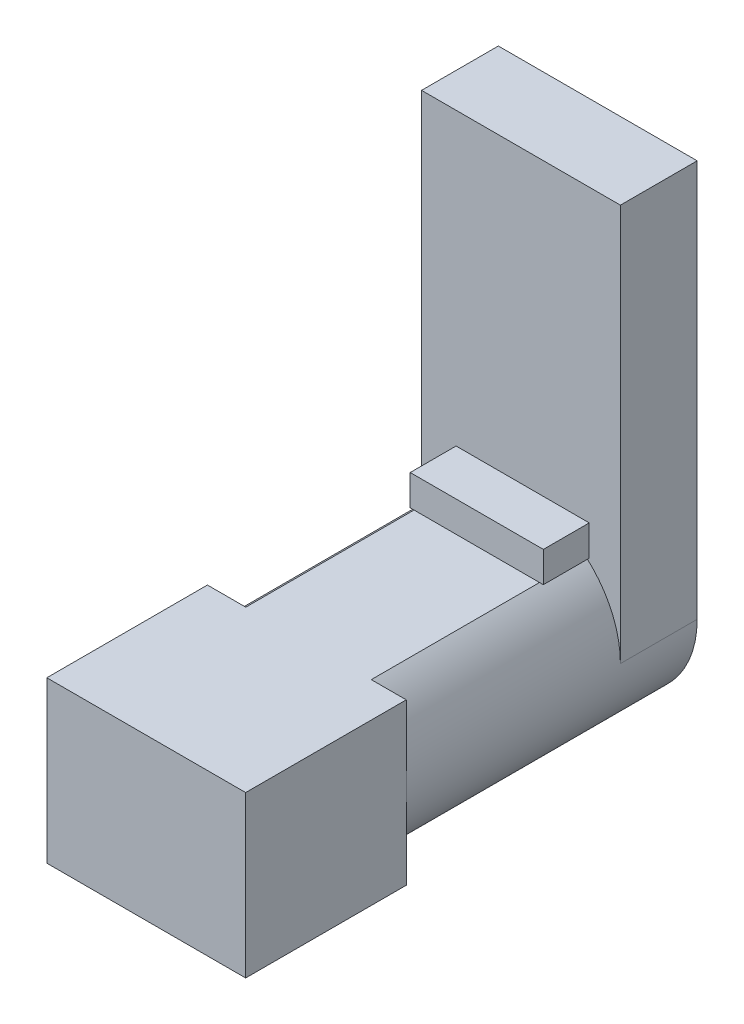
ISO-10303-21;
HEADER;
FILE_DESCRIPTION(('STEP AP214'),'2;1');
FILE_NAME('part.step','',(''),(''),'','','');
FILE_SCHEMA(('AUTOMOTIVE_DESIGN { 1 0 10303 214 1 1 1 1 }'));
ENDSEC;
DATA;
#1=APPLICATION_CONTEXT('core data for automotive mechanical design processes');
#2=APPLICATION_PROTOCOL_DEFINITION('international standard','automotive_design',2000,#1);
#3=PRODUCT_CONTEXT('',#1,'mechanical');
#4=PRODUCT('Part','Part','',(#3));
#5=PRODUCT_RELATED_PRODUCT_CATEGORY('part','',(#4));
#6=PRODUCT_DEFINITION_FORMATION('','',#4);
#7=PRODUCT_DEFINITION_CONTEXT('part definition',#1,'design');
#8=PRODUCT_DEFINITION('design','',#6,#7);
#9=PRODUCT_DEFINITION_SHAPE('','',#8);
#10=(LENGTH_UNIT() NAMED_UNIT(*) SI_UNIT(.MILLI.,.METRE.));
#11=(NAMED_UNIT(*) PLANE_ANGLE_UNIT() SI_UNIT($,.RADIAN.));
#12=(NAMED_UNIT(*) SI_UNIT($,.STERADIAN.) SOLID_ANGLE_UNIT());
#13=UNCERTAINTY_MEASURE_WITH_UNIT(LENGTH_MEASURE(1.E-05),#10,'distance_accuracy_value','');
#14=(GEOMETRIC_REPRESENTATION_CONTEXT(3) GLOBAL_UNCERTAINTY_ASSIGNED_CONTEXT((#13)) GLOBAL_UNIT_ASSIGNED_CONTEXT((#10,
#11,#12)) REPRESENTATION_CONTEXT('',''));
#15=CARTESIAN_POINT('',(0.,0.,0.));
#16=DIRECTION('',(0.,0.,1.));
#17=DIRECTION('',(1.,0.,0.));
#18=AXIS2_PLACEMENT_3D('',#15,#16,#17);
#19=CARTESIAN_POINT('',(-0.361724532970591,0.,-15.5));
#20=DIRECTION('',(0.,0.,1.));
#21=DIRECTION('',(1.,0.,0.));
#22=AXIS2_PLACEMENT_3D('',#19,#20,#21);
#23=CYLINDRICAL_SURFACE('',#22,6.13827546702941);
#24=CARTESIAN_POINT('',(-0.361724532970591,0.,0.));
#25=DIRECTION('',(0.,0.,-1.));
#26=DIRECTION('',(-1.,0.,0.));
#27=AXIS2_PLACEMENT_3D('',#24,#25,#26);
#28=CIRCLE('',#27,6.13827546702941);
#29=CARTESIAN_POINT('',(-6.5,0.,0.));
#30=VERTEX_POINT('',#29);
#31=CARTESIAN_POINT('',(-3.9915903306462,4.95,0.));
#32=VERTEX_POINT('',#31);
#33=EDGE_CURVE('E336',#30,#32,#28,.T.);
#34=ORIENTED_EDGE('',*,*,#33,.T.);
#35=DIRECTION('',(0.,0.,1.));
#36=VECTOR('',#35,1.);
#37=CARTESIAN_POINT('',(-3.9915903306462,4.94999999999999,-15.5));
#38=LINE('',#37,#36);
#39=CARTESIAN_POINT('',(-3.9915903306462,4.94999999999999,-11.));
#40=VERTEX_POINT('',#39);
#41=EDGE_CURVE('E298',#32,#40,#38,.F.);
#42=ORIENTED_EDGE('',*,*,#41,.T.);
#43=CARTESIAN_POINT('',(-3.9915903306462,4.94999999999999,-14.));
#44=VERTEX_POINT('',#43);
#45=EDGE_CURVE('E297',#40,#44,#38,.F.);
#46=ORIENTED_EDGE('',*,*,#45,.T.);
#47=CARTESIAN_POINT('',(-0.361724532970591,0.,-14.));
#48=DIRECTION('',(0.,0.,-1.));
#49=DIRECTION('',(-1.,0.,0.));
#50=AXIS2_PLACEMENT_3D('',#47,#48,#49);
#51=CIRCLE('',#50,6.13827546702941);
#52=CARTESIAN_POINT('',(-6.5,0.,-14.));
#53=VERTEX_POINT('',#52);
#54=EDGE_CURVE('E228',#53,#44,#51,.T.);
#55=ORIENTED_EDGE('',*,*,#54,.F.);
#56=DIRECTION('',(0.,0.,-1.));
#57=VECTOR('',#56,1.);
#58=CARTESIAN_POINT('',(-6.5,0.,-14.));
#59=LINE('',#58,#57);
#60=CARTESIAN_POINT('',(-6.5,0.,-19.02));
#61=VERTEX_POINT('',#60);
#62=EDGE_CURVE('E224',#53,#61,#59,.T.);
#63=ORIENTED_EDGE('',*,*,#62,.T.);
#64=CARTESIAN_POINT('',(-0.3617245329706,0.,-19.02));
#65=DIRECTION('',(0.,0.,-1.));
#66=DIRECTION('',(1.,0.,0.));
#67=AXIS2_PLACEMENT_3D('',#64,#65,#66);
#68=CIRCLE('',#67,6.1382754670294);
#69=CARTESIAN_POINT('',(-2.9839231732599,-5.55,-19.02));
#70=VERTEX_POINT('',#69);
#71=EDGE_CURVE('E315',#70,#61,#68,.T.);
#72=ORIENTED_EDGE('',*,*,#71,.F.);
#73=DIRECTION('',(0.,0.,1.));
#74=VECTOR('',#73,1.);
#75=CARTESIAN_POINT('',(-2.98392317325991,-5.55,-15.5));
#76=LINE('',#75,#74);
#77=CARTESIAN_POINT('',(-2.9839231732599,-5.55,0.));
#78=VERTEX_POINT('',#77);
#79=EDGE_CURVE('E335',#70,#78,#76,.T.);
#80=ORIENTED_EDGE('',*,*,#79,.T.);
#81=EDGE_CURVE('E331',#78,#30,#28,.T.);
#82=ORIENTED_EDGE('',*,*,#81,.T.);
#83=EDGE_LOOP('',(#34,#42,#46,#55,#63,#72,#80,#82));
#84=FACE_BOUND('',#83,.T.);
#85=ADVANCED_FACE('F92',(#84),#23,.T.);
#86=CARTESIAN_POINT('',(0.,0.,0.));
#87=DIRECTION('',(0.,0.,1.));
#88=DIRECTION('',(1.,0.,0.));
#89=AXIS2_PLACEMENT_3D('',#86,#87,#88);
#90=PLANE('',#89);
#91=CARTESIAN_POINT('',(0.,0.,0.));
#92=DIRECTION('',(0.,0.,-1.));
#93=DIRECTION('',(1.,0.,0.));
#94=AXIS2_PLACEMENT_3D('',#91,#92,#93);
#95=CIRCLE('',#94,6.5);
#96=CARTESIAN_POINT('',(4.21277818072588,4.94999999999999,0.));
#97=VERTEX_POINT('',#96);
#98=CARTESIAN_POINT('',(6.5,0.,0.));
#99=VERTEX_POINT('',#98);
#100=EDGE_CURVE('E328',#97,#99,#95,.T.);
#101=ORIENTED_EDGE('',*,*,#100,.F.);
#102=DIRECTION('',(1.,0.,0.));
#103=VECTOR('',#102,1.);
#104=CARTESIAN_POINT('',(0.,4.95,0.));
#105=LINE('',#104,#103);
#106=CARTESIAN_POINT('',(6.5,4.95,0.));
#107=VERTEX_POINT('',#106);
#108=EDGE_CURVE('E288',#97,#107,#105,.T.);
#109=ORIENTED_EDGE('',*,*,#108,.T.);
#110=DIRECTION('',(0.,1.,0.));
#111=VECTOR('',#110,1.);
#112=CARTESIAN_POINT('',(6.5,-5.55,0.));
#113=LINE('',#112,#111);
#114=EDGE_CURVE('E340',#99,#107,#113,.T.);
#115=ORIENTED_EDGE('',*,*,#114,.F.);
#116=EDGE_LOOP('',(#101,#109,#115));
#117=FACE_BOUND('',#116,.T.);
#118=ADVANCED_FACE('F393',(#117),#90,.F.);
#119=CARTESIAN_POINT('',(3.38341543414343,-5.55,0.));
#120=VERTEX_POINT('',#119);
#121=EDGE_CURVE('E332',#99,#120,#95,.T.);
#122=ORIENTED_EDGE('',*,*,#121,.F.);
#123=CARTESIAN_POINT('',(6.5,-5.55,0.));
#124=VERTEX_POINT('',#123);
#125=EDGE_CURVE('E341',#124,#99,#113,.T.);
#126=ORIENTED_EDGE('',*,*,#125,.F.);
#127=DIRECTION('',(1.,0.,0.));
#128=VECTOR('',#127,1.);
#129=CARTESIAN_POINT('',(-6.5,-5.55,0.));
#130=LINE('',#129,#128);
#131=EDGE_CURVE('E344',#120,#124,#130,.T.);
#132=ORIENTED_EDGE('',*,*,#131,.F.);
#133=EDGE_LOOP('',(#122,#126,#132));
#134=FACE_BOUND('',#133,.T.);
#135=ADVANCED_FACE('F398',(#134),#90,.F.);
#136=ORIENTED_EDGE('',*,*,#81,.F.);
#137=CARTESIAN_POINT('',(-6.5,-5.55,0.));
#138=VERTEX_POINT('',#137);
#139=EDGE_CURVE('E345',#138,#78,#130,.T.);
#140=ORIENTED_EDGE('',*,*,#139,.F.);
#141=DIRECTION('',(0.,1.,0.));
#142=VECTOR('',#141,1.);
#143=CARTESIAN_POINT('',(-6.5,-5.55,0.));
#144=LINE('',#143,#142);
#145=EDGE_CURVE('E349',#138,#30,#144,.T.);
#146=ORIENTED_EDGE('',*,*,#145,.T.);
#147=EDGE_LOOP('',(#136,#140,#146));
#148=FACE_BOUND('',#147,.T.);
#149=ADVANCED_FACE('F376',(#148),#90,.F.);
#150=CARTESIAN_POINT('',(-6.5,-5.55,10.));
#151=DIRECTION('',(-1.,0.,0.));
#152=DIRECTION('',(0.,0.,1.));
#153=AXIS2_PLACEMENT_3D('',#150,#151,#152);
#154=PLANE('',#153);
#155=DIRECTION('',(0.,0.,1.));
#156=VECTOR('',#155,1.);
#157=CARTESIAN_POINT('',(-6.5,4.95,10.5));
#158=LINE('',#157,#156);
#159=CARTESIAN_POINT('',(-6.5,4.95,0.));
#160=VERTEX_POINT('',#159);
#161=CARTESIAN_POINT('',(-6.5,4.94999999999999,10.5));
#162=VERTEX_POINT('',#161);
#163=EDGE_CURVE('E116',#160,#162,#158,.T.);
#164=ORIENTED_EDGE('',*,*,#163,.F.);
#165=EDGE_CURVE('E348',#30,#160,#144,.T.);
#166=ORIENTED_EDGE('',*,*,#165,.F.);
#167=ORIENTED_EDGE('',*,*,#145,.F.);
#168=DIRECTION('',(0.,0.,-1.));
#169=VECTOR('',#168,1.);
#170=CARTESIAN_POINT('',(-6.5,-5.55,10.));
#171=LINE('',#170,#169);
#172=CARTESIAN_POINT('',(-6.5,-5.55,10.5));
#173=VERTEX_POINT('',#172);
#174=EDGE_CURVE('E353',#173,#138,#171,.T.);
#175=ORIENTED_EDGE('',*,*,#174,.F.);
#176=DIRECTION('',(0.,-1.,0.));
#177=VECTOR('',#176,1.);
#178=CARTESIAN_POINT('',(-6.5,5.55,10.5));
#179=LINE('',#178,#177);
#180=EDGE_CURVE('E301',#162,#173,#179,.T.);
#181=ORIENTED_EDGE('',*,*,#180,.F.);
#182=EDGE_LOOP('',(#164,#166,#167,#175,#181));
#183=FACE_BOUND('',#182,.T.);
#184=ADVANCED_FACE('F371',(#183),#154,.T.);
#185=CARTESIAN_POINT('',(-6.5,-5.55,10.));
#186=DIRECTION('',(0.,1.,0.));
#187=DIRECTION('',(0.,0.,1.));
#188=AXIS2_PLACEMENT_3D('',#185,#186,#187);
#189=PLANE('',#188);
#190=DIRECTION('',(0.,0.,1.));
#191=VECTOR('',#190,1.);
#192=CARTESIAN_POINT('',(3.38341543414344,-5.55,-15.5));
#193=LINE('',#192,#191);
#194=CARTESIAN_POINT('',(3.38341543414344,-5.55,-19.02));
#195=VERTEX_POINT('',#194);
#196=EDGE_CURVE('E338',#195,#120,#193,.T.);
#197=ORIENTED_EDGE('',*,*,#196,.T.);
#198=ORIENTED_EDGE('',*,*,#131,.T.);
#199=DIRECTION('',(0.,0.,-1.));
#200=VECTOR('',#199,1.);
#201=CARTESIAN_POINT('',(6.5,-5.55,10.));
#202=LINE('',#201,#200);
#203=CARTESIAN_POINT('',(6.5,-5.55,10.5));
#204=VERTEX_POINT('',#203);
#205=EDGE_CURVE('E352',#204,#124,#202,.T.);
#206=ORIENTED_EDGE('',*,*,#205,.F.);
#207=DIRECTION('',(1.,0.,0.));
#208=VECTOR('',#207,1.);
#209=CARTESIAN_POINT('',(-6.5,-5.55,10.5));
#210=LINE('',#209,#208);
#211=EDGE_CURVE('E303',#173,#204,#210,.T.);
#212=ORIENTED_EDGE('',*,*,#211,.F.);
#213=ORIENTED_EDGE('',*,*,#174,.T.);
#214=ORIENTED_EDGE('',*,*,#139,.T.);
#215=ORIENTED_EDGE('',*,*,#79,.F.);
#216=DIRECTION('',(-1.,0.,0.));
#217=VECTOR('',#216,1.);
#218=CARTESIAN_POINT('',(3.38341543414344,-5.55,-19.02));
#219=LINE('',#218,#217);
#220=EDGE_CURVE('E312',#195,#70,#219,.T.);
#221=ORIENTED_EDGE('',*,*,#220,.F.);
#222=EDGE_LOOP('',(#197,#198,#206,#212,#213,#214,#215,#221));
#223=FACE_BOUND('',#222,.T.);
#224=ADVANCED_FACE('F378',(#223),#189,.F.);
#225=CARTESIAN_POINT('',(6.5,-5.55,10.));
#226=DIRECTION('',(-1.,0.,0.));
#227=DIRECTION('',(0.,0.,1.));
#228=AXIS2_PLACEMENT_3D('',#225,#226,#227);
#229=PLANE('',#228);
#230=ORIENTED_EDGE('',*,*,#114,.T.);
#231=DIRECTION('',(0.,0.,1.));
#232=VECTOR('',#231,1.);
#233=CARTESIAN_POINT('',(6.5,4.95,10.));
#234=LINE('',#233,#232);
#235=CARTESIAN_POINT('',(6.5,4.95,10.5));
#236=VERTEX_POINT('',#235);
#237=EDGE_CURVE('E291',#107,#236,#234,.T.);
#238=ORIENTED_EDGE('',*,*,#237,.T.);
#239=DIRECTION('',(0.,1.,0.));
#240=VECTOR('',#239,1.);
#241=CARTESIAN_POINT('',(6.5,5.55,10.5));
#242=LINE('',#241,#240);
#243=EDGE_CURVE('E306',#204,#236,#242,.T.);
#244=ORIENTED_EDGE('',*,*,#243,.F.);
#245=ORIENTED_EDGE('',*,*,#205,.T.);
#246=ORIENTED_EDGE('',*,*,#125,.T.);
#247=EDGE_LOOP('',(#230,#238,#244,#245,#246));
#248=FACE_BOUND('',#247,.T.);
#249=ADVANCED_FACE('F94',(#248),#229,.F.);
#250=ORIENTED_EDGE('',*,*,#165,.T.);
#251=DIRECTION('',(1.,0.,0.));
#252=VECTOR('',#251,1.);
#253=CARTESIAN_POINT('',(0.,4.95,0.));
#254=LINE('',#253,#252);
#255=EDGE_CURVE('E294',#160,#32,#254,.T.);
#256=ORIENTED_EDGE('',*,*,#255,.T.);
#257=ORIENTED_EDGE('',*,*,#33,.F.);
#258=EDGE_LOOP('',(#250,#256,#257));
#259=FACE_BOUND('',#258,.T.);
#260=ADVANCED_FACE('F368',(#259),#90,.F.);
#261=CARTESIAN_POINT('',(0.,0.,-15.5));
#262=DIRECTION('',(0.,0.,1.));
#263=DIRECTION('',(1.,0.,0.));
#264=AXIS2_PLACEMENT_3D('',#261,#262,#263);
#265=CYLINDRICAL_SURFACE('',#264,6.5);
#266=CARTESIAN_POINT('',(0.,0.,-14.));
#267=DIRECTION('',(0.,0.,-1.));
#268=DIRECTION('',(-1.,0.,0.));
#269=AXIS2_PLACEMENT_3D('',#266,#267,#268);
#270=CIRCLE('',#269,6.5);
#271=CARTESIAN_POINT('',(4.21277818072588,4.94999999999999,-14.));
#272=VERTEX_POINT('',#271);
#273=CARTESIAN_POINT('',(6.5,0.,-14.));
#274=VERTEX_POINT('',#273);
#275=EDGE_CURVE('E326',#272,#274,#270,.T.);
#276=ORIENTED_EDGE('',*,*,#275,.F.);
#277=DIRECTION('',(0.,0.,1.));
#278=VECTOR('',#277,1.);
#279=CARTESIAN_POINT('',(4.21277818072588,4.94999999999999,-15.5));
#280=LINE('',#279,#278);
#281=CARTESIAN_POINT('',(4.21277818072588,4.94999999999999,-11.));
#282=VERTEX_POINT('',#281);
#283=EDGE_CURVE('E285',#272,#282,#280,.T.);
#284=ORIENTED_EDGE('',*,*,#283,.T.);
#285=EDGE_CURVE('E284',#282,#97,#280,.T.);
#286=ORIENTED_EDGE('',*,*,#285,.T.);
#287=ORIENTED_EDGE('',*,*,#100,.T.);
#288=ORIENTED_EDGE('',*,*,#121,.T.);
#289=ORIENTED_EDGE('',*,*,#196,.F.);
#290=CARTESIAN_POINT('',(0.,0.,-19.02));
#291=DIRECTION('',(0.,0.,-1.));
#292=DIRECTION('',(1.,0.,0.));
#293=AXIS2_PLACEMENT_3D('',#290,#291,#292);
#294=CIRCLE('',#293,6.50000000000004);
#295=CARTESIAN_POINT('',(6.5,0.,-19.02));
#296=VERTEX_POINT('',#295);
#297=EDGE_CURVE('E309',#296,#195,#294,.T.);
#298=ORIENTED_EDGE('',*,*,#297,.F.);
#299=DIRECTION('',(0.,0.,-1.));
#300=VECTOR('',#299,1.);
#301=CARTESIAN_POINT('',(6.5,0.,-14.));
#302=LINE('',#301,#300);
#303=EDGE_CURVE('E229',#274,#296,#302,.T.);
#304=ORIENTED_EDGE('',*,*,#303,.F.);
#305=EDGE_LOOP('',(#276,#284,#286,#287,#288,#289,#298,#304));
#306=FACE_BOUND('',#305,.T.);
#307=ADVANCED_FACE('F395',(#306),#265,.T.);
#308=CARTESIAN_POINT('',(-6.5,0.,-14.));
#309=DIRECTION('',(1.,0.,0.));
#310=DIRECTION('',(0.,1.,0.));
#311=AXIS2_PLACEMENT_3D('',#308,#309,#310);
#312=PLANE('',#311);
#313=DIRECTION('',(0.,-1.,0.));
#314=VECTOR('',#313,1.);
#315=CARTESIAN_POINT('',(-6.5,0.,-14.));
#316=LINE('',#315,#314);
#317=CARTESIAN_POINT('',(-6.5,25.96,-14.));
#318=VERTEX_POINT('',#317);
#319=EDGE_CURVE('E218',#318,#53,#316,.T.);
#320=ORIENTED_EDGE('',*,*,#319,.F.);
#321=DIRECTION('',(0.,0.,1.));
#322=VECTOR('',#321,1.);
#323=CARTESIAN_POINT('',(-6.5,25.96,-19.02));
#324=LINE('',#323,#322);
#325=CARTESIAN_POINT('',(-6.5,25.96,-19.02));
#326=VERTEX_POINT('',#325);
#327=EDGE_CURVE('E223',#326,#318,#324,.T.);
#328=ORIENTED_EDGE('',*,*,#327,.F.);
#329=DIRECTION('',(0.,1.,0.));
#330=VECTOR('',#329,1.);
#331=CARTESIAN_POINT('',(-6.5,10.96,-19.02));
#332=LINE('',#331,#330);
#333=EDGE_CURVE('E318',#61,#326,#332,.T.);
#334=ORIENTED_EDGE('',*,*,#333,.F.);
#335=ORIENTED_EDGE('',*,*,#62,.F.);
#336=EDGE_LOOP('',(#320,#328,#334,#335));
#337=FACE_BOUND('',#336,.T.);
#338=ADVANCED_FACE('F220',(#337),#312,.F.);
#339=CARTESIAN_POINT('',(6.5,0.,-14.));
#340=DIRECTION('',(1.,0.,0.));
#341=DIRECTION('',(0.,1.,0.));
#342=AXIS2_PLACEMENT_3D('',#339,#340,#341);
#343=PLANE('',#342);
#344=ORIENTED_EDGE('',*,*,#303,.T.);
#345=DIRECTION('',(0.,-1.,0.));
#346=VECTOR('',#345,1.);
#347=CARTESIAN_POINT('',(6.5,0.,-19.02));
#348=LINE('',#347,#346);
#349=CARTESIAN_POINT('',(6.5,25.96,-19.02));
#350=VERTEX_POINT('',#349);
#351=EDGE_CURVE('E320',#350,#296,#348,.T.);
#352=ORIENTED_EDGE('',*,*,#351,.F.);
#353=DIRECTION('',(0.,0.,-1.));
#354=VECTOR('',#353,1.);
#355=CARTESIAN_POINT('',(6.5,25.96,-19.02));
#356=LINE('',#355,#354);
#357=CARTESIAN_POINT('',(6.5,25.96,-14.));
#358=VERTEX_POINT('',#357);
#359=EDGE_CURVE('E239',#358,#350,#356,.T.);
#360=ORIENTED_EDGE('',*,*,#359,.F.);
#361=DIRECTION('',(0.,-1.,0.));
#362=VECTOR('',#361,1.);
#363=CARTESIAN_POINT('',(6.5,0.,-14.));
#364=LINE('',#363,#362);
#365=EDGE_CURVE('E235',#358,#274,#364,.T.);
#366=ORIENTED_EDGE('',*,*,#365,.T.);
#367=EDGE_LOOP('',(#344,#352,#360,#366));
#368=FACE_BOUND('',#367,.T.);
#369=ADVANCED_FACE('F405',(#368),#343,.T.);
#370=CARTESIAN_POINT('',(0.,0.,-14.));
#371=DIRECTION('',(0.,0.,-1.));
#372=DIRECTION('',(-1.,0.,0.));
#373=AXIS2_PLACEMENT_3D('',#370,#371,#372);
#374=PLANE('',#373);
#375=ORIENTED_EDGE('',*,*,#54,.T.);
#376=DIRECTION('',(-1.,0.,0.));
#377=VECTOR('',#376,1.);
#378=CARTESIAN_POINT('',(0.,4.94999999999999,-14.));
#379=LINE('',#378,#377);
#380=CARTESIAN_POINT('',(-4.2415903306462,4.94999999999999,-14.));
#381=VERTEX_POINT('',#380);
#382=EDGE_CURVE('E267',#44,#381,#379,.T.);
#383=ORIENTED_EDGE('',*,*,#382,.T.);
#384=DIRECTION('',(0.,1.,0.));
#385=VECTOR('',#384,1.);
#386=CARTESIAN_POINT('',(-4.2415903306462,0.,-14.));
#387=LINE('',#386,#385);
#388=CARTESIAN_POINT('',(-4.2415903306462,6.94999999999999,-14.));
#389=VERTEX_POINT('',#388);
#390=EDGE_CURVE('E251',#381,#389,#387,.T.);
#391=ORIENTED_EDGE('',*,*,#390,.T.);
#392=DIRECTION('',(-1.,0.,0.));
#393=VECTOR('',#392,1.);
#394=CARTESIAN_POINT('',(0.,6.94999999999999,-14.));
#395=LINE('',#394,#393);
#396=CARTESIAN_POINT('',(4.46277818072588,6.94999999999999,-14.));
#397=VERTEX_POINT('',#396);
#398=EDGE_CURVE('E256',#397,#389,#395,.T.);
#399=ORIENTED_EDGE('',*,*,#398,.F.);
#400=DIRECTION('',(0.,1.,0.));
#401=VECTOR('',#400,1.);
#402=CARTESIAN_POINT('',(4.46277818072588,0.,-14.));
#403=LINE('',#402,#401);
#404=CARTESIAN_POINT('',(4.46277818072588,4.94999999999999,-14.));
#405=VERTEX_POINT('',#404);
#406=EDGE_CURVE('E271',#405,#397,#403,.T.);
#407=ORIENTED_EDGE('',*,*,#406,.F.);
#408=EDGE_CURVE('E268',#405,#272,#379,.T.);
#409=ORIENTED_EDGE('',*,*,#408,.T.);
#410=ORIENTED_EDGE('',*,*,#275,.T.);
#411=ORIENTED_EDGE('',*,*,#365,.F.);
#412=DIRECTION('',(1.,0.,0.));
#413=VECTOR('',#412,1.);
#414=CARTESIAN_POINT('',(-6.5,25.96,-14.));
#415=LINE('',#414,#413);
#416=EDGE_CURVE('E232',#318,#358,#415,.T.);
#417=ORIENTED_EDGE('',*,*,#416,.F.);
#418=ORIENTED_EDGE('',*,*,#319,.T.);
#419=EDGE_LOOP('',(#375,#383,#391,#399,#407,#409,#410,#411,#417,#418));
#420=FACE_BOUND('',#419,.T.);
#421=ADVANCED_FACE('F233',(#420),#374,.F.);
#422=CARTESIAN_POINT('',(0.,0.,-19.02));
#423=DIRECTION('',(0.,0.,1.));
#424=DIRECTION('',(1.,0.,0.));
#425=AXIS2_PLACEMENT_3D('',#422,#423,#424);
#426=PLANE('',#425);
#427=CARTESIAN_POINT('',(0.0480605380062099,-0.289999999999999,-19.02));
#428=DIRECTION('',(0.,0.,-1.));
#429=DIRECTION('',(-1.,0.,0.));
#430=AXIS2_PLACEMENT_3D('',#427,#428,#429);
#431=CIRCLE('',#430,4.75);
#432=CARTESIAN_POINT('',(-4.70193946199379,-0.289999999999999,-19.02));
#433=VERTEX_POINT('',#432);
#434=EDGE_CURVE('E12',#433,#433,#431,.T.);
#435=ORIENTED_EDGE('',*,*,#434,.F.);
#436=EDGE_LOOP('',(#435));
#437=FACE_BOUND('',#436,.T.);
#438=ORIENTED_EDGE('',*,*,#297,.T.);
#439=ORIENTED_EDGE('',*,*,#220,.T.);
#440=ORIENTED_EDGE('',*,*,#71,.T.);
#441=ORIENTED_EDGE('',*,*,#333,.T.);
#442=DIRECTION('',(-1.,0.,0.));
#443=VECTOR('',#442,1.);
#444=CARTESIAN_POINT('',(-6.5,25.96,-19.02));
#445=LINE('',#444,#443);
#446=EDGE_CURVE('E244',#350,#326,#445,.T.);
#447=ORIENTED_EDGE('',*,*,#446,.F.);
#448=ORIENTED_EDGE('',*,*,#351,.T.);
#449=EDGE_LOOP('',(#438,#439,#440,#441,#447,#448));
#450=FACE_BOUND('',#449,.T.);
#451=ADVANCED_FACE('F402',(#437,#450),#426,.F.);
#452=CARTESIAN_POINT('',(0.,0.,10.5));
#453=DIRECTION('',(0.,0.,1.));
#454=DIRECTION('',(1.,0.,0.));
#455=AXIS2_PLACEMENT_3D('',#452,#453,#454);
#456=PLANE('',#455);
#457=DIRECTION('',(1.,0.,0.));
#458=VECTOR('',#457,1.);
#459=CARTESIAN_POINT('',(0.,4.95,10.5));
#460=LINE('',#459,#458);
#461=EDGE_CURVE('E356',#162,#236,#460,.T.);
#462=ORIENTED_EDGE('',*,*,#461,.F.);
#463=ORIENTED_EDGE('',*,*,#180,.T.);
#464=ORIENTED_EDGE('',*,*,#211,.T.);
#465=ORIENTED_EDGE('',*,*,#243,.T.);
#466=EDGE_LOOP('',(#462,#463,#464,#465));
#467=FACE_BOUND('',#466,.T.);
#468=ADVANCED_FACE('F382',(#467),#456,.T.);
#469=CARTESIAN_POINT('',(8.5,4.95,10.5));
#470=DIRECTION('',(0.,-1.,0.));
#471=DIRECTION('',(0.,0.,-1.));
#472=AXIS2_PLACEMENT_3D('',#469,#470,#471);
#473=PLANE('',#472);
#474=ORIENTED_EDGE('',*,*,#285,.F.);
#475=DIRECTION('',(-1.,0.,0.));
#476=VECTOR('',#475,1.);
#477=CARTESIAN_POINT('',(8.5,4.94999999999999,-11.));
#478=LINE('',#477,#476);
#479=EDGE_CURVE('E96',#282,#40,#478,.T.);
#480=ORIENTED_EDGE('',*,*,#479,.T.);
#481=ORIENTED_EDGE('',*,*,#41,.F.);
#482=ORIENTED_EDGE('',*,*,#255,.F.);
#483=ORIENTED_EDGE('',*,*,#163,.T.);
#484=ORIENTED_EDGE('',*,*,#461,.T.);
#485=ORIENTED_EDGE('',*,*,#237,.F.);
#486=ORIENTED_EDGE('',*,*,#108,.F.);
#487=EDGE_LOOP('',(#474,#480,#481,#482,#483,#484,#485,#486));
#488=FACE_BOUND('',#487,.T.);
#489=ADVANCED_FACE('F390',(#488),#473,.F.);
#490=CARTESIAN_POINT('',(0.,4.94999999999999,-11.));
#491=DIRECTION('',(0.,-1.,0.));
#492=DIRECTION('',(0.,0.,-1.));
#493=AXIS2_PLACEMENT_3D('',#490,#491,#492);
#494=PLANE('',#493);
#495=ORIENTED_EDGE('',*,*,#45,.F.);
#496=DIRECTION('',(-1.,0.,0.));
#497=VECTOR('',#496,1.);
#498=CARTESIAN_POINT('',(0.,4.94999999999999,-11.));
#499=LINE('',#498,#497);
#500=CARTESIAN_POINT('',(-4.2415903306462,4.94999999999999,-11.));
#501=VERTEX_POINT('',#500);
#502=EDGE_CURVE('E108',#40,#501,#499,.T.);
#503=ORIENTED_EDGE('',*,*,#502,.T.);
#504=DIRECTION('',(0.,0.,-1.));
#505=VECTOR('',#504,1.);
#506=CARTESIAN_POINT('',(-4.2415903306462,4.94999999999999,-11.));
#507=LINE('',#506,#505);
#508=EDGE_CURVE('E281',#501,#381,#507,.T.);
#509=ORIENTED_EDGE('',*,*,#508,.T.);
#510=ORIENTED_EDGE('',*,*,#382,.F.);
#511=EDGE_LOOP('',(#495,#503,#509,#510));
#512=FACE_BOUND('',#511,.T.);
#513=ADVANCED_FACE('F492',(#512),#494,.T.);
#514=ORIENTED_EDGE('',*,*,#283,.F.);
#515=ORIENTED_EDGE('',*,*,#408,.F.);
#516=DIRECTION('',(0.,0.,-1.));
#517=VECTOR('',#516,1.);
#518=CARTESIAN_POINT('',(4.46277818072588,4.94999999999999,-11.));
#519=LINE('',#518,#517);
#520=CARTESIAN_POINT('',(4.46277818072588,4.94999999999999,-11.));
#521=VERTEX_POINT('',#520);
#522=EDGE_CURVE('E279',#521,#405,#519,.T.);
#523=ORIENTED_EDGE('',*,*,#522,.F.);
#524=EDGE_CURVE('E257',#521,#282,#499,.T.);
#525=ORIENTED_EDGE('',*,*,#524,.T.);
#526=EDGE_LOOP('',(#514,#515,#523,#525));
#527=FACE_BOUND('',#526,.T.);
#528=ADVANCED_FACE('F409',(#527),#494,.T.);
#529=CARTESIAN_POINT('',(-4.2415903306462,0.,-11.));
#530=DIRECTION('',(-1.,0.,0.));
#531=DIRECTION('',(0.,0.,1.));
#532=AXIS2_PLACEMENT_3D('',#529,#530,#531);
#533=PLANE('',#532);
#534=ORIENTED_EDGE('',*,*,#390,.F.);
#535=ORIENTED_EDGE('',*,*,#508,.F.);
#536=DIRECTION('',(0.,1.,0.));
#537=VECTOR('',#536,1.);
#538=CARTESIAN_POINT('',(-4.2415903306462,0.,-11.));
#539=LINE('',#538,#537);
#540=CARTESIAN_POINT('',(-4.2415903306462,6.94999999999999,-11.));
#541=VERTEX_POINT('',#540);
#542=EDGE_CURVE('E253',#501,#541,#539,.T.);
#543=ORIENTED_EDGE('',*,*,#542,.T.);
#544=DIRECTION('',(0.,0.,-1.));
#545=VECTOR('',#544,1.);
#546=CARTESIAN_POINT('',(-4.2415903306462,6.94999999999999,-11.));
#547=LINE('',#546,#545);
#548=EDGE_CURVE('E264',#541,#389,#547,.T.);
#549=ORIENTED_EDGE('',*,*,#548,.T.);
#550=EDGE_LOOP('',(#534,#535,#543,#549));
#551=FACE_BOUND('',#550,.T.);
#552=ADVANCED_FACE('F506',(#551),#533,.T.);
#553=CARTESIAN_POINT('',(4.46277818072588,0.,-11.));
#554=DIRECTION('',(-1.,0.,0.));
#555=DIRECTION('',(0.,0.,1.));
#556=AXIS2_PLACEMENT_3D('',#553,#554,#555);
#557=PLANE('',#556);
#558=ORIENTED_EDGE('',*,*,#406,.T.);
#559=DIRECTION('',(0.,0.,-1.));
#560=VECTOR('',#559,1.);
#561=CARTESIAN_POINT('',(4.46277818072588,6.94999999999999,-11.));
#562=LINE('',#561,#560);
#563=CARTESIAN_POINT('',(4.46277818072588,6.94999999999999,-11.));
#564=VERTEX_POINT('',#563);
#565=EDGE_CURVE('E276',#564,#397,#562,.T.);
#566=ORIENTED_EDGE('',*,*,#565,.F.);
#567=DIRECTION('',(0.,1.,0.));
#568=VECTOR('',#567,1.);
#569=CARTESIAN_POINT('',(4.46277818072588,0.,-11.));
#570=LINE('',#569,#568);
#571=EDGE_CURVE('E260',#521,#564,#570,.T.);
#572=ORIENTED_EDGE('',*,*,#571,.F.);
#573=ORIENTED_EDGE('',*,*,#522,.T.);
#574=EDGE_LOOP('',(#558,#566,#572,#573));
#575=FACE_BOUND('',#574,.T.);
#576=ADVANCED_FACE('F424',(#575),#557,.F.);
#577=CARTESIAN_POINT('',(0.,6.94999999999999,-11.));
#578=DIRECTION('',(0.,-1.,0.));
#579=DIRECTION('',(0.,0.,-1.));
#580=AXIS2_PLACEMENT_3D('',#577,#578,#579);
#581=PLANE('',#580);
#582=ORIENTED_EDGE('',*,*,#398,.T.);
#583=ORIENTED_EDGE('',*,*,#548,.F.);
#584=DIRECTION('',(-1.,0.,0.));
#585=VECTOR('',#584,1.);
#586=CARTESIAN_POINT('',(0.,6.94999999999999,-11.));
#587=LINE('',#586,#585);
#588=EDGE_CURVE('E262',#564,#541,#587,.T.);
#589=ORIENTED_EDGE('',*,*,#588,.F.);
#590=ORIENTED_EDGE('',*,*,#565,.T.);
#591=EDGE_LOOP('',(#582,#583,#589,#590));
#592=FACE_BOUND('',#591,.T.);
#593=ADVANCED_FACE('F415',(#592),#581,.F.);
#594=CARTESIAN_POINT('',(0.,0.,-11.));
#595=DIRECTION('',(0.,0.,1.));
#596=DIRECTION('',(1.,0.,0.));
#597=AXIS2_PLACEMENT_3D('',#594,#595,#596);
#598=PLANE('',#597);
#599=ORIENTED_EDGE('',*,*,#542,.F.);
#600=ORIENTED_EDGE('',*,*,#502,.F.);
#601=ORIENTED_EDGE('',*,*,#479,.F.);
#602=ORIENTED_EDGE('',*,*,#524,.F.);
#603=ORIENTED_EDGE('',*,*,#571,.T.);
#604=ORIENTED_EDGE('',*,*,#588,.T.);
#605=EDGE_LOOP('',(#599,#600,#601,#602,#603,#604));
#606=FACE_BOUND('',#605,.T.);
#607=ADVANCED_FACE('F412',(#606),#598,.T.);
#608=CARTESIAN_POINT('',(0.0480605380062099,-0.289999999999999,-20.));
#609=DIRECTION('',(0.,0.,1.));
#610=DIRECTION('',(1.,0.,0.));
#611=AXIS2_PLACEMENT_3D('',#608,#609,#610);
#612=CYLINDRICAL_SURFACE('',#611,4.75);
#613=CARTESIAN_POINT('',(0.0480605380062099,-0.289999999999999,-20.));
#614=DIRECTION('',(0.,0.,-1.));
#615=DIRECTION('',(-1.,0.,0.));
#616=AXIS2_PLACEMENT_3D('',#613,#614,#615);
#617=CIRCLE('',#616,4.75);
#618=CARTESIAN_POINT('',(-4.70193946199379,-0.289999999999999,-20.));
#619=VERTEX_POINT('',#618);
#620=EDGE_CURVE('E249',#619,#619,#617,.T.);
#621=ORIENTED_EDGE('',*,*,#620,.F.);
#622=EDGE_LOOP('',(#621));
#623=FACE_BOUND('',#622,.T.);
#624=ORIENTED_EDGE('',*,*,#434,.T.);
#625=EDGE_LOOP('',(#624));
#626=FACE_BOUND('',#625,.T.);
#627=ADVANCED_FACE('F414',(#623,#626),#612,.T.);
#628=CARTESIAN_POINT('',(0.0480605380062099,-0.289999999999999,-20.));
#629=DIRECTION('',(0.,0.,-1.));
#630=DIRECTION('',(-1.,0.,0.));
#631=AXIS2_PLACEMENT_3D('',#628,#629,#630);
#632=PLANE('',#631);
#633=ORIENTED_EDGE('',*,*,#620,.T.);
#634=EDGE_LOOP('',(#633));
#635=FACE_BOUND('',#634,.T.);
#636=ADVANCED_FACE('F421',(#635),#632,.T.);
#637=CARTESIAN_POINT('',(0.,25.96,0.));
#638=DIRECTION('',(0.,1.,0.));
#639=DIRECTION('',(0.,0.,1.));
#640=AXIS2_PLACEMENT_3D('',#637,#638,#639);
#641=PLANE('',#640);
#642=ORIENTED_EDGE('',*,*,#327,.T.);
#643=ORIENTED_EDGE('',*,*,#416,.T.);
#644=ORIENTED_EDGE('',*,*,#359,.T.);
#645=ORIENTED_EDGE('',*,*,#446,.T.);
#646=EDGE_LOOP('',(#642,#643,#644,#645));
#647=FACE_BOUND('',#646,.T.);
#648=ADVANCED_FACE('F242',(#647),#641,.T.);
#649=CLOSED_SHELL('',(#85,#118,#135,#149,#184,#224,#249,#260,#307,#338,#369,#421,#451,#468,#489,
#513,#528,#552,#576,#593,#607,#627,#636,#648));
#650=MANIFOLD_SOLID_BREP('B2',#649);
#651=ADVANCED_BREP_SHAPE_REPRESENTATION('',(#18,#650),#14);
#652=SHAPE_DEFINITION_REPRESENTATION(#9,#651);
ENDSEC;
END-ISO-10303-21;
